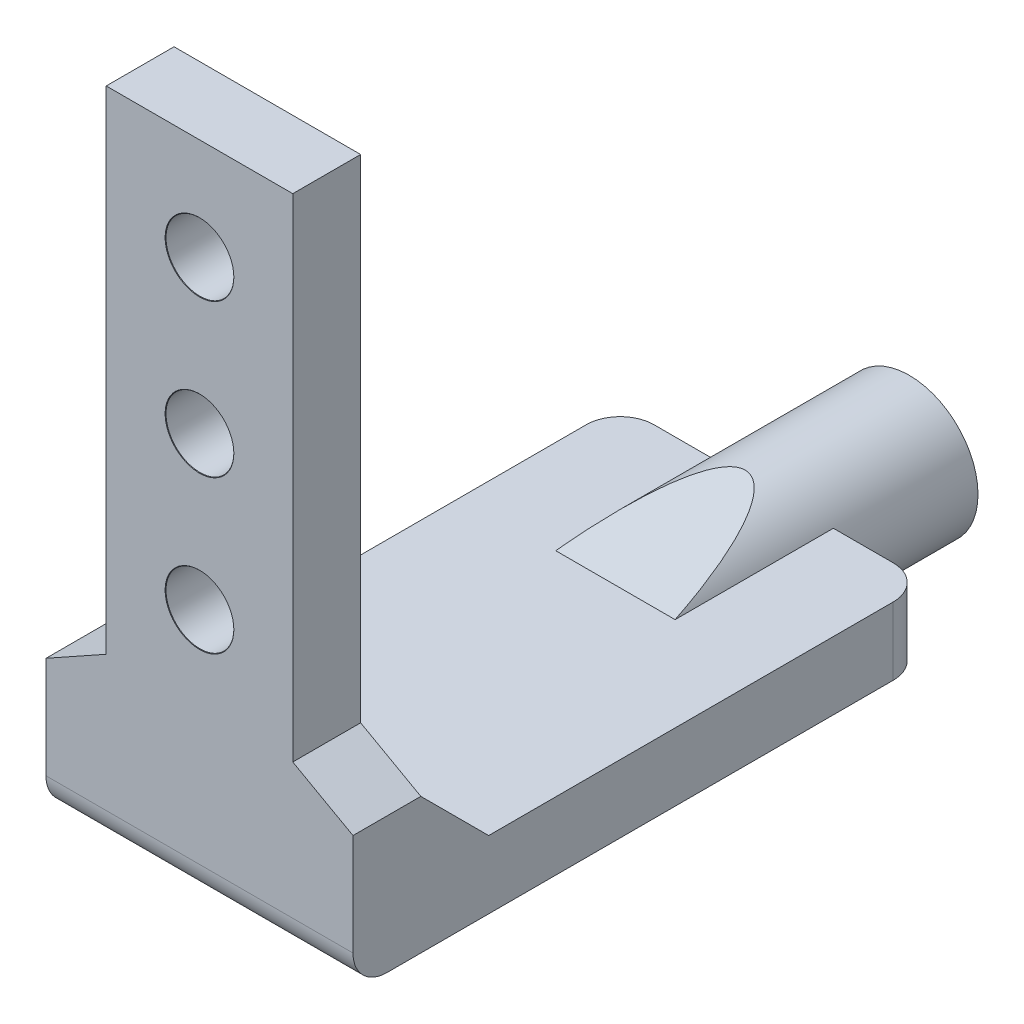
ISO-10303-21;
HEADER;
FILE_DESCRIPTION(('STEP AP214'),'2;1');
FILE_NAME('part.step','',(''),(''),'','','');
FILE_SCHEMA(('AUTOMOTIVE_DESIGN { 1 0 10303 214 1 1 1 1 }'));
ENDSEC;
DATA;
#1=APPLICATION_CONTEXT('core data for automotive mechanical design processes');
#2=APPLICATION_PROTOCOL_DEFINITION('international standard','automotive_design',2000,#1);
#3=PRODUCT_CONTEXT('',#1,'mechanical');
#4=PRODUCT('Part','Part','',(#3));
#5=PRODUCT_RELATED_PRODUCT_CATEGORY('part','',(#4));
#6=PRODUCT_DEFINITION_FORMATION('','',#4);
#7=PRODUCT_DEFINITION_CONTEXT('part definition',#1,'design');
#8=PRODUCT_DEFINITION('design','',#6,#7);
#9=PRODUCT_DEFINITION_SHAPE('','',#8);
#10=(LENGTH_UNIT() NAMED_UNIT(*) SI_UNIT(.MILLI.,.METRE.));
#11=(NAMED_UNIT(*) PLANE_ANGLE_UNIT() SI_UNIT($,.RADIAN.));
#12=(NAMED_UNIT(*) SI_UNIT($,.STERADIAN.) SOLID_ANGLE_UNIT());
#13=UNCERTAINTY_MEASURE_WITH_UNIT(LENGTH_MEASURE(1.E-05),#10,'distance_accuracy_value','');
#14=(GEOMETRIC_REPRESENTATION_CONTEXT(3) GLOBAL_UNCERTAINTY_ASSIGNED_CONTEXT((#13)) GLOBAL_UNIT_ASSIGNED_CONTEXT((#10,
#11,#12)) REPRESENTATION_CONTEXT('',''));
#15=CARTESIAN_POINT('',(0.,0.,0.));
#16=DIRECTION('',(0.,0.,1.));
#17=DIRECTION('',(1.,0.,0.));
#18=AXIS2_PLACEMENT_3D('',#15,#16,#17);
#19=CARTESIAN_POINT('',(-9.05,2.,41.85));
#20=DIRECTION('',(0.,-1.,0.));
#21=DIRECTION('',(0.,0.,-1.));
#22=AXIS2_PLACEMENT_3D('',#19,#20,#21);
#23=PLANE('',#22);
#24=DIRECTION('',(0.,0.,-1.));
#25=VECTOR('',#24,1.);
#26=CARTESIAN_POINT('',(-9.05,2.,41.85));
#27=LINE('',#26,#25);
#28=CARTESIAN_POINT('',(-9.05,2.,33.85));
#29=VERTEX_POINT('',#28);
#30=CARTESIAN_POINT('',(-9.05,2.,10.));
#31=VERTEX_POINT('',#30);
#32=EDGE_CURVE('E246',#29,#31,#27,.T.);
#33=ORIENTED_EDGE('',*,*,#32,.F.);
#34=DIRECTION('',(1.,0.,0.));
#35=VECTOR('',#34,1.);
#36=CARTESIAN_POINT('',(9.05,2.,33.85));
#37=LINE('',#36,#35);
#38=CARTESIAN_POINT('',(9.05,2.,33.85));
#39=VERTEX_POINT('',#38);
#40=EDGE_CURVE('E300',#29,#39,#37,.T.);
#41=ORIENTED_EDGE('',*,*,#40,.T.);
#42=DIRECTION('',(0.,0.,-1.));
#43=VECTOR('',#42,1.);
#44=CARTESIAN_POINT('',(9.05,2.,41.85));
#45=LINE('',#44,#43);
#46=CARTESIAN_POINT('',(9.05,2.,10.));
#47=VERTEX_POINT('',#46);
#48=EDGE_CURVE('E248',#39,#47,#45,.T.);
#49=ORIENTED_EDGE('',*,*,#48,.T.);
#50=CARTESIAN_POINT('',(7.05,2.,10.));
#51=DIRECTION('',(0.,-1.,0.));
#52=DIRECTION('',(0.,0.,-1.));
#53=AXIS2_PLACEMENT_3D('',#50,#51,#52);
#54=CIRCLE('',#53,2.);
#55=CARTESIAN_POINT('',(7.04999999999999,2.,8.));
#56=VERTEX_POINT('',#55);
#57=EDGE_CURVE('E287',#47,#56,#54,.F.);
#58=ORIENTED_EDGE('',*,*,#57,.T.);
#59=DIRECTION('',(-1.,0.,0.));
#60=VECTOR('',#59,1.);
#61=CARTESIAN_POINT('',(-9.05,2.,8.));
#62=LINE('',#61,#60);
#63=CARTESIAN_POINT('',(3.52171833058807,2.,8.));
#64=VERTEX_POINT('',#63);
#65=EDGE_CURVE('E239',#56,#64,#62,.T.);
#66=ORIENTED_EDGE('',*,*,#65,.T.);
#67=DIRECTION('',(0.,0.,-1.));
#68=VECTOR('',#67,1.);
#69=CARTESIAN_POINT('',(3.52171833058807,2.,8.));
#70=LINE('',#69,#68);
#71=CARTESIAN_POINT('',(3.52171833058807,2.,17.3301270189226));
#72=VERTEX_POINT('',#71);
#73=EDGE_CURVE('E257',#64,#72,#70,.F.);
#74=ORIENTED_EDGE('',*,*,#73,.T.);
#75=DIRECTION('',(-1.,0.,0.));
#76=VECTOR('',#75,1.);
#77=CARTESIAN_POINT('',(-9.05,2.,17.3301270189226));
#78=LINE('',#77,#76);
#79=CARTESIAN_POINT('',(-3.52171833058807,2.,17.3301270189226));
#80=VERTEX_POINT('',#79);
#81=EDGE_CURVE('E260',#72,#80,#78,.T.);
#82=ORIENTED_EDGE('',*,*,#81,.T.);
#83=DIRECTION('',(0.,0.,-1.));
#84=VECTOR('',#83,1.);
#85=CARTESIAN_POINT('',(-3.52171833058807,2.,17.3301270189226));
#86=LINE('',#85,#84);
#87=CARTESIAN_POINT('',(-3.52171833058807,2.,8.));
#88=VERTEX_POINT('',#87);
#89=EDGE_CURVE('E263',#80,#88,#86,.T.);
#90=ORIENTED_EDGE('',*,*,#89,.T.);
#91=CARTESIAN_POINT('',(-7.05,2.,8.));
#92=VERTEX_POINT('',#91);
#93=EDGE_CURVE('E231',#88,#92,#62,.T.);
#94=ORIENTED_EDGE('',*,*,#93,.T.);
#95=CARTESIAN_POINT('',(-7.05,2.,10.));
#96=DIRECTION('',(0.,-1.,0.));
#97=DIRECTION('',(0.,0.,-1.));
#98=AXIS2_PLACEMENT_3D('',#95,#96,#97);
#99=CIRCLE('',#98,2.);
#100=EDGE_CURVE('E289',#92,#31,#99,.F.);
#101=ORIENTED_EDGE('',*,*,#100,.T.);
#102=EDGE_LOOP('',(#33,#41,#49,#58,#66,#74,#82,#90,#94,#101));
#103=FACE_BOUND('',#102,.T.);
#104=ADVANCED_FACE('F45',(#103),#23,.F.);
#105=CARTESIAN_POINT('',(0.,0.,8.));
#106=DIRECTION('',(0.,0.,-1.));
#107=DIRECTION('',(-1.,0.,0.));
#108=AXIS2_PLACEMENT_3D('',#105,#106,#107);
#109=CYLINDRICAL_SURFACE('',#108,4.05);
#110=ORIENTED_EDGE('',*,*,#89,.F.);
#111=CARTESIAN_POINT('',(0.,0.,24.7942286340604));
#112=DIRECTION('',(0.,-0.965925826289069,-0.258819045102517));
#113=DIRECTION('',(0.,0.258819045102517,-0.965925826289069));
#114=AXIS2_PLACEMENT_3D('',#111,#112,#113);
#115=ELLIPSE('',#114,15.6479983858831,4.05);
#116=EDGE_CURVE('E265',#80,#72,#115,.T.);
#117=ORIENTED_EDGE('',*,*,#116,.T.);
#118=ORIENTED_EDGE('',*,*,#73,.F.);
#119=CARTESIAN_POINT('',(0.,0.,8.));
#120=DIRECTION('',(0.,0.,1.));
#121=DIRECTION('',(1.,0.,0.));
#122=AXIS2_PLACEMENT_3D('',#119,#120,#121);
#123=CIRCLE('',#122,4.05);
#124=CARTESIAN_POINT('',(3.52171833058807,-2.,8.));
#125=VERTEX_POINT('',#124);
#126=EDGE_CURVE('E251',#125,#64,#123,.T.);
#127=ORIENTED_EDGE('',*,*,#126,.F.);
#128=DIRECTION('',(0.,0.,-1.));
#129=VECTOR('',#128,1.);
#130=CARTESIAN_POINT('',(3.52171833058807,-2.,17.3301270189226));
#131=LINE('',#130,#129);
#132=CARTESIAN_POINT('',(3.52171833058807,-2.,17.3301270189226));
#133=VERTEX_POINT('',#132);
#134=EDGE_CURVE('E273',#133,#125,#131,.T.);
#135=ORIENTED_EDGE('',*,*,#134,.F.);
#136=CARTESIAN_POINT('',(0.,0.,24.7942286340604));
#137=DIRECTION('',(0.,0.965925826289069,-0.258819045102517));
#138=DIRECTION('',(0.,-0.258819045102517,-0.965925826289069));
#139=AXIS2_PLACEMENT_3D('',#136,#137,#138);
#140=ELLIPSE('',#139,15.6479983858831,4.05);
#141=CARTESIAN_POINT('',(-3.52171833058807,-2.,17.3301270189226));
#142=VERTEX_POINT('',#141);
#143=EDGE_CURVE('E275',#133,#142,#140,.T.);
#144=ORIENTED_EDGE('',*,*,#143,.T.);
#145=DIRECTION('',(0.,0.,-1.));
#146=VECTOR('',#145,1.);
#147=CARTESIAN_POINT('',(-3.52171833058807,-2.,8.));
#148=LINE('',#147,#146);
#149=CARTESIAN_POINT('',(-3.52171833058807,-2.,8.));
#150=VERTEX_POINT('',#149);
#151=EDGE_CURVE('E267',#150,#142,#148,.F.);
#152=ORIENTED_EDGE('',*,*,#151,.F.);
#153=EDGE_CURVE('E254',#88,#150,#123,.T.);
#154=ORIENTED_EDGE('',*,*,#153,.F.);
#155=EDGE_LOOP('',(#110,#117,#118,#127,#135,#144,#152,#154));
#156=FACE_BOUND('',#155,.T.);
#157=CARTESIAN_POINT('',(0.,0.,0.));
#158=DIRECTION('',(0.,0.,1.));
#159=DIRECTION('',(1.,0.,0.));
#160=AXIS2_PLACEMENT_3D('',#157,#158,#159);
#161=CIRCLE('',#160,4.05);
#162=CARTESIAN_POINT('',(4.05,0.,0.));
#163=VERTEX_POINT('',#162);
#164=EDGE_CURVE('E250',#163,#163,#161,.T.);
#165=ORIENTED_EDGE('',*,*,#164,.T.);
#166=EDGE_LOOP('',(#165));
#167=FACE_BOUND('',#166,.T.);
#168=ADVANCED_FACE('F356',(#156,#167),#109,.T.);
#169=CARTESIAN_POINT('',(0.,0.,0.));
#170=DIRECTION('',(0.,0.,1.));
#171=DIRECTION('',(1.,0.,0.));
#172=AXIS2_PLACEMENT_3D('',#169,#170,#171);
#173=PLANE('',#172);
#174=ORIENTED_EDGE('',*,*,#164,.F.);
#175=EDGE_LOOP('',(#174));
#176=FACE_BOUND('',#175,.T.);
#177=ADVANCED_FACE('F364',(#176),#173,.F.);
#178=CARTESIAN_POINT('',(0.,0.,8.));
#179=DIRECTION('',(0.,0.,-1.));
#180=DIRECTION('',(-1.,0.,0.));
#181=AXIS2_PLACEMENT_3D('',#178,#179,#180);
#182=PLANE('',#181);
#183=DIRECTION('',(1.,0.,0.));
#184=VECTOR('',#183,1.);
#185=CARTESIAN_POINT('',(-9.05,-2.,8.));
#186=LINE('',#185,#184);
#187=CARTESIAN_POINT('',(-7.05,-2.,8.));
#188=VERTEX_POINT('',#187);
#189=EDGE_CURVE('E236',#188,#150,#186,.T.);
#190=ORIENTED_EDGE('',*,*,#189,.F.);
#191=DIRECTION('',(0.,-1.,0.));
#192=VECTOR('',#191,1.);
#193=CARTESIAN_POINT('',(-7.05,2.,8.));
#194=LINE('',#193,#192);
#195=EDGE_CURVE('E285',#188,#92,#194,.F.);
#196=ORIENTED_EDGE('',*,*,#195,.T.);
#197=ORIENTED_EDGE('',*,*,#93,.F.);
#198=ORIENTED_EDGE('',*,*,#153,.T.);
#199=EDGE_LOOP('',(#190,#196,#197,#198));
#200=FACE_BOUND('',#199,.T.);
#201=ADVANCED_FACE('F373',(#200),#182,.T.);
#202=CARTESIAN_POINT('',(9.05,-2.,41.85));
#203=DIRECTION('',(-1.,0.,0.));
#204=DIRECTION('',(0.,0.,1.));
#205=AXIS2_PLACEMENT_3D('',#202,#203,#204);
#206=PLANE('',#205);
#207=DIRECTION('',(0.,-0.707106781186551,-0.707106781186544));
#208=VECTOR('',#207,1.);
#209=CARTESIAN_POINT('',(9.05,3.99999999999998,35.85));
#210=LINE('',#209,#208);
#211=CARTESIAN_POINT('',(9.05,6.00000000000004,37.85));
#212=VERTEX_POINT('',#211);
#213=EDGE_CURVE('E304',#39,#212,#210,.F.);
#214=ORIENTED_EDGE('',*,*,#213,.T.);
#215=DIRECTION('',(0.,0.,-1.));
#216=VECTOR('',#215,1.);
#217=CARTESIAN_POINT('',(9.05,6.00000000000004,41.85));
#218=LINE('',#217,#216);
#219=CARTESIAN_POINT('',(9.05,6.00000000000004,41.85));
#220=VERTEX_POINT('',#219);
#221=EDGE_CURVE('E197',#220,#212,#218,.T.);
#222=ORIENTED_EDGE('',*,*,#221,.F.);
#223=DIRECTION('',(0.,1.,0.));
#224=VECTOR('',#223,1.);
#225=CARTESIAN_POINT('',(9.05,-2.,41.85));
#226=LINE('',#225,#224);
#227=CARTESIAN_POINT('',(9.05,0.,41.85));
#228=VERTEX_POINT('',#227);
#229=EDGE_CURVE('E232',#228,#220,#226,.T.);
#230=ORIENTED_EDGE('',*,*,#229,.F.);
#231=CARTESIAN_POINT('',(9.05,0.,39.85));
#232=DIRECTION('',(-1.,0.,0.));
#233=DIRECTION('',(0.,0.,1.));
#234=AXIS2_PLACEMENT_3D('',#231,#232,#233);
#235=CIRCLE('',#234,2.);
#236=CARTESIAN_POINT('',(9.05,-2.,39.85));
#237=VERTEX_POINT('',#236);
#238=EDGE_CURVE('E316',#228,#237,#235,.F.);
#239=ORIENTED_EDGE('',*,*,#238,.T.);
#240=DIRECTION('',(0.,0.,-1.));
#241=VECTOR('',#240,1.);
#242=CARTESIAN_POINT('',(9.05,-2.,41.85));
#243=LINE('',#242,#241);
#244=CARTESIAN_POINT('',(9.05,-2.,10.));
#245=VERTEX_POINT('',#244);
#246=EDGE_CURVE('E238',#237,#245,#243,.T.);
#247=ORIENTED_EDGE('',*,*,#246,.T.);
#248=DIRECTION('',(0.,1.,0.));
#249=VECTOR('',#248,1.);
#250=CARTESIAN_POINT('',(9.05,2.,10.));
#251=LINE('',#250,#249);
#252=EDGE_CURVE('E292',#245,#47,#251,.T.);
#253=ORIENTED_EDGE('',*,*,#252,.T.);
#254=ORIENTED_EDGE('',*,*,#48,.F.);
#255=EDGE_LOOP('',(#214,#222,#230,#239,#247,#253,#254));
#256=FACE_BOUND('',#255,.T.);
#257=ADVANCED_FACE('F332',(#256),#206,.F.);
#258=CARTESIAN_POINT('',(-9.05,-2.,41.85));
#259=DIRECTION('',(1.,0.,0.));
#260=DIRECTION('',(0.,0.,-1.));
#261=AXIS2_PLACEMENT_3D('',#258,#259,#260);
#262=PLANE('',#261);
#263=DIRECTION('',(0.,-1.,0.));
#264=VECTOR('',#263,1.);
#265=CARTESIAN_POINT('',(-9.05,-2.,41.85));
#266=LINE('',#265,#264);
#267=CARTESIAN_POINT('',(-9.05,6.00000000000004,41.85));
#268=VERTEX_POINT('',#267);
#269=CARTESIAN_POINT('',(-9.05,0.,41.85));
#270=VERTEX_POINT('',#269);
#271=EDGE_CURVE('E235',#268,#270,#266,.T.);
#272=ORIENTED_EDGE('',*,*,#271,.F.);
#273=DIRECTION('',(0.,0.,-1.));
#274=VECTOR('',#273,1.);
#275=CARTESIAN_POINT('',(-9.05,6.00000000000004,41.85));
#276=LINE('',#275,#274);
#277=CARTESIAN_POINT('',(-9.05,6.00000000000004,37.85));
#278=VERTEX_POINT('',#277);
#279=EDGE_CURVE('E170',#268,#278,#276,.T.);
#280=ORIENTED_EDGE('',*,*,#279,.T.);
#281=DIRECTION('',(0.,0.707106781186551,0.707106781186544));
#282=VECTOR('',#281,1.);
#283=CARTESIAN_POINT('',(-9.05,3.99999999999998,35.85));
#284=LINE('',#283,#282);
#285=EDGE_CURVE('E302',#278,#29,#284,.F.);
#286=ORIENTED_EDGE('',*,*,#285,.T.);
#287=ORIENTED_EDGE('',*,*,#32,.T.);
#288=DIRECTION('',(0.,-1.,0.));
#289=VECTOR('',#288,1.);
#290=CARTESIAN_POINT('',(-9.05,-2.,10.));
#291=LINE('',#290,#289);
#292=CARTESIAN_POINT('',(-9.05,-2.,10.));
#293=VERTEX_POINT('',#292);
#294=EDGE_CURVE('E277',#31,#293,#291,.T.);
#295=ORIENTED_EDGE('',*,*,#294,.T.);
#296=DIRECTION('',(0.,0.,-1.));
#297=VECTOR('',#296,1.);
#298=CARTESIAN_POINT('',(-9.05,-2.,41.85));
#299=LINE('',#298,#297);
#300=CARTESIAN_POINT('',(-9.05,-2.,39.85));
#301=VERTEX_POINT('',#300);
#302=EDGE_CURVE('E244',#301,#293,#299,.T.);
#303=ORIENTED_EDGE('',*,*,#302,.F.);
#304=CARTESIAN_POINT('',(-9.05,0.,39.85));
#305=DIRECTION('',(1.,0.,0.));
#306=DIRECTION('',(0.,0.,-1.));
#307=AXIS2_PLACEMENT_3D('',#304,#305,#306);
#308=CIRCLE('',#307,2.);
#309=EDGE_CURVE('E11',#301,#270,#308,.F.);
#310=ORIENTED_EDGE('',*,*,#309,.T.);
#311=EDGE_LOOP('',(#272,#280,#286,#287,#295,#303,#310));
#312=FACE_BOUND('',#311,.T.);
#313=ADVANCED_FACE('F326',(#312),#262,.F.);
#314=CARTESIAN_POINT('',(-9.05,-2.,41.85));
#315=DIRECTION('',(0.,1.,0.));
#316=DIRECTION('',(0.,0.,1.));
#317=AXIS2_PLACEMENT_3D('',#314,#315,#316);
#318=PLANE('',#317);
#319=ORIENTED_EDGE('',*,*,#246,.F.);
#320=DIRECTION('',(1.,0.,0.));
#321=VECTOR('',#320,1.);
#322=CARTESIAN_POINT('',(-9.05,-2.,39.85));
#323=LINE('',#322,#321);
#324=EDGE_CURVE('E53',#237,#301,#323,.F.);
#325=ORIENTED_EDGE('',*,*,#324,.T.);
#326=ORIENTED_EDGE('',*,*,#302,.T.);
#327=CARTESIAN_POINT('',(-7.05,-2.,10.));
#328=DIRECTION('',(0.,1.,0.));
#329=DIRECTION('',(0.,0.,1.));
#330=AXIS2_PLACEMENT_3D('',#327,#328,#329);
#331=CIRCLE('',#330,2.);
#332=EDGE_CURVE('E283',#293,#188,#331,.F.);
#333=ORIENTED_EDGE('',*,*,#332,.T.);
#334=ORIENTED_EDGE('',*,*,#189,.T.);
#335=ORIENTED_EDGE('',*,*,#151,.T.);
#336=DIRECTION('',(1.,0.,0.));
#337=VECTOR('',#336,1.);
#338=CARTESIAN_POINT('',(-9.05,-2.,17.3301270189226));
#339=LINE('',#338,#337);
#340=EDGE_CURVE('E270',#142,#133,#339,.T.);
#341=ORIENTED_EDGE('',*,*,#340,.T.);
#342=ORIENTED_EDGE('',*,*,#134,.T.);
#343=CARTESIAN_POINT('',(7.04999999999999,-2.,8.));
#344=VERTEX_POINT('',#343);
#345=EDGE_CURVE('E241',#125,#344,#186,.T.);
#346=ORIENTED_EDGE('',*,*,#345,.T.);
#347=CARTESIAN_POINT('',(7.05,-2.,10.));
#348=DIRECTION('',(0.,1.,0.));
#349=DIRECTION('',(0.,0.,1.));
#350=AXIS2_PLACEMENT_3D('',#347,#348,#349);
#351=CIRCLE('',#350,2.);
#352=EDGE_CURVE('E280',#344,#245,#351,.F.);
#353=ORIENTED_EDGE('',*,*,#352,.T.);
#354=EDGE_LOOP('',(#319,#325,#326,#333,#334,#335,#341,#342,#346,#353));
#355=FACE_BOUND('',#354,.T.);
#356=ADVANCED_FACE('F321',(#355),#318,.F.);
#357=CARTESIAN_POINT('',(0.,0.,41.85));
#358=DIRECTION('',(0.,0.,-1.));
#359=DIRECTION('',(-1.,0.,0.));
#360=AXIS2_PLACEMENT_3D('',#357,#358,#359);
#361=PLANE('',#360);
#362=CARTESIAN_POINT('',(0.,31.,41.85));
#363=DIRECTION('',(0.,0.,1.));
#364=DIRECTION('',(1.,0.,0.));
#365=AXIS2_PLACEMENT_3D('',#362,#363,#364);
#366=CIRCLE('',#365,2.025);
#367=CARTESIAN_POINT('',(2.025,31.,41.85));
#368=VERTEX_POINT('',#367);
#369=EDGE_CURVE('E203',#368,#368,#366,.T.);
#370=ORIENTED_EDGE('',*,*,#369,.F.);
#371=EDGE_LOOP('',(#370));
#372=FACE_BOUND('',#371,.T.);
#373=CARTESIAN_POINT('',(0.,22.,41.85));
#374=DIRECTION('',(0.,0.,1.));
#375=DIRECTION('',(1.,0.,0.));
#376=AXIS2_PLACEMENT_3D('',#373,#374,#375);
#377=CIRCLE('',#376,2.025);
#378=CARTESIAN_POINT('',(2.025,22.,41.85));
#379=VERTEX_POINT('',#378);
#380=EDGE_CURVE('E213',#379,#379,#377,.T.);
#381=ORIENTED_EDGE('',*,*,#380,.F.);
#382=EDGE_LOOP('',(#381));
#383=FACE_BOUND('',#382,.T.);
#384=CARTESIAN_POINT('',(0.,13.,41.85));
#385=DIRECTION('',(0.,0.,1.));
#386=DIRECTION('',(1.,0.,0.));
#387=AXIS2_PLACEMENT_3D('',#384,#385,#386);
#388=CIRCLE('',#387,2.025);
#389=CARTESIAN_POINT('',(2.025,13.,41.85));
#390=VERTEX_POINT('',#389);
#391=EDGE_CURVE('E220',#390,#390,#388,.T.);
#392=ORIENTED_EDGE('',*,*,#391,.F.);
#393=EDGE_LOOP('',(#392));
#394=FACE_BOUND('',#393,.T.);
#395=DIRECTION('',(0.,-1.,0.));
#396=VECTOR('',#395,1.);
#397=CARTESIAN_POINT('',(-5.5,7.98000000000004,41.85));
#398=LINE('',#397,#396);
#399=CARTESIAN_POINT('',(-5.5,37.,41.85));
#400=VERTEX_POINT('',#399);
#401=CARTESIAN_POINT('',(-5.5,7.98000000000004,41.85));
#402=VERTEX_POINT('',#401);
#403=EDGE_CURVE('E60',#400,#402,#398,.T.);
#404=ORIENTED_EDGE('',*,*,#403,.T.);
#405=DIRECTION('',(-0.873343748456126,-0.48710440054736,0.));
#406=VECTOR('',#405,1.);
#407=CARTESIAN_POINT('',(-9.05,6.00000000000004,41.85));
#408=LINE('',#407,#406);
#409=EDGE_CURVE('E174',#402,#268,#408,.T.);
#410=ORIENTED_EDGE('',*,*,#409,.T.);
#411=ORIENTED_EDGE('',*,*,#271,.T.);
#412=DIRECTION('',(1.,0.,0.));
#413=VECTOR('',#412,1.);
#414=CARTESIAN_POINT('',(0.,0.,41.85));
#415=LINE('',#414,#413);
#416=EDGE_CURVE('E307',#270,#228,#415,.T.);
#417=ORIENTED_EDGE('',*,*,#416,.T.);
#418=ORIENTED_EDGE('',*,*,#229,.T.);
#419=DIRECTION('',(-0.873343748456126,0.48710440054736,0.));
#420=VECTOR('',#419,1.);
#421=CARTESIAN_POINT('',(9.05,6.00000000000004,41.85));
#422=LINE('',#421,#420);
#423=CARTESIAN_POINT('',(5.5,7.98000000000004,41.85));
#424=VERTEX_POINT('',#423);
#425=EDGE_CURVE('E192',#220,#424,#422,.T.);
#426=ORIENTED_EDGE('',*,*,#425,.T.);
#427=DIRECTION('',(0.,1.,0.));
#428=VECTOR('',#427,1.);
#429=CARTESIAN_POINT('',(5.5,7.98000000000004,41.85));
#430=LINE('',#429,#428);
#431=CARTESIAN_POINT('',(5.5,37.,41.85));
#432=VERTEX_POINT('',#431);
#433=EDGE_CURVE('E195',#424,#432,#430,.T.);
#434=ORIENTED_EDGE('',*,*,#433,.T.);
#435=DIRECTION('',(1.,0.,0.));
#436=VECTOR('',#435,1.);
#437=CARTESIAN_POINT('',(-9.05,37.,41.85));
#438=LINE('',#437,#436);
#439=EDGE_CURVE('E183',#400,#432,#438,.T.);
#440=ORIENTED_EDGE('',*,*,#439,.F.);
#441=EDGE_LOOP('',(#404,#410,#411,#417,#418,#426,#434,#440));
#442=FACE_BOUND('',#441,.T.);
#443=ADVANCED_FACE('F181',(#372,#383,#394,#442),#361,.F.);
#444=ORIENTED_EDGE('',*,*,#65,.F.);
#445=DIRECTION('',(0.,1.,0.));
#446=VECTOR('',#445,1.);
#447=CARTESIAN_POINT('',(7.05,-2.,8.));
#448=LINE('',#447,#446);
#449=EDGE_CURVE('E295',#56,#344,#448,.F.);
#450=ORIENTED_EDGE('',*,*,#449,.T.);
#451=ORIENTED_EDGE('',*,*,#345,.F.);
#452=ORIENTED_EDGE('',*,*,#126,.T.);
#453=EDGE_LOOP('',(#444,#450,#451,#452));
#454=FACE_BOUND('',#453,.T.);
#455=ADVANCED_FACE('F385',(#454),#182,.T.);
#456=CARTESIAN_POINT('',(-9.05,2.,17.3301270189226));
#457=DIRECTION('',(0.,-0.965925826289069,-0.258819045102517));
#458=DIRECTION('',(-1.,0.,0.));
#459=AXIS2_PLACEMENT_3D('',#456,#457,#458);
#460=PLANE('',#459);
#461=ORIENTED_EDGE('',*,*,#81,.F.);
#462=ORIENTED_EDGE('',*,*,#116,.F.);
#463=EDGE_LOOP('',(#461,#462));
#464=FACE_BOUND('',#463,.T.);
#465=ADVANCED_FACE('F378',(#464),#460,.F.);
#466=CARTESIAN_POINT('',(-9.05,-2.,17.3301270189226));
#467=DIRECTION('',(0.,0.965925826289069,-0.258819045102517));
#468=DIRECTION('',(1.,0.,0.));
#469=AXIS2_PLACEMENT_3D('',#466,#467,#468);
#470=PLANE('',#469);
#471=ORIENTED_EDGE('',*,*,#340,.F.);
#472=ORIENTED_EDGE('',*,*,#143,.F.);
#473=EDGE_LOOP('',(#471,#472));
#474=FACE_BOUND('',#473,.T.);
#475=ADVANCED_FACE('F384',(#474),#470,.F.);
#476=CARTESIAN_POINT('',(-7.05,-2.,10.));
#477=DIRECTION('',(0.,1.,0.));
#478=DIRECTION('',(0.,0.,1.));
#479=AXIS2_PLACEMENT_3D('',#476,#477,#478);
#480=CYLINDRICAL_SURFACE('',#479,2.);
#481=ORIENTED_EDGE('',*,*,#100,.F.);
#482=ORIENTED_EDGE('',*,*,#195,.F.);
#483=ORIENTED_EDGE('',*,*,#332,.F.);
#484=ORIENTED_EDGE('',*,*,#294,.F.);
#485=EDGE_LOOP('',(#481,#482,#483,#484));
#486=FACE_BOUND('',#485,.T.);
#487=ADVANCED_FACE('F392',(#486),#480,.T.);
#488=CARTESIAN_POINT('',(7.05,-2.,10.));
#489=DIRECTION('',(0.,-1.,0.));
#490=DIRECTION('',(0.,0.,-1.));
#491=AXIS2_PLACEMENT_3D('',#488,#489,#490);
#492=CYLINDRICAL_SURFACE('',#491,2.);
#493=ORIENTED_EDGE('',*,*,#352,.F.);
#494=ORIENTED_EDGE('',*,*,#449,.F.);
#495=ORIENTED_EDGE('',*,*,#57,.F.);
#496=ORIENTED_EDGE('',*,*,#252,.F.);
#497=EDGE_LOOP('',(#493,#494,#495,#496));
#498=FACE_BOUND('',#497,.T.);
#499=ADVANCED_FACE('F396',(#498),#492,.T.);
#500=CARTESIAN_POINT('',(-9.05,37.,37.85));
#501=DIRECTION('',(0.,0.,1.));
#502=DIRECTION('',(1.,0.,0.));
#503=AXIS2_PLACEMENT_3D('',#500,#501,#502);
#504=PLANE('',#503);
#505=CARTESIAN_POINT('',(0.,31.,37.85));
#506=DIRECTION('',(0.,0.,1.));
#507=DIRECTION('',(1.,0.,0.));
#508=AXIS2_PLACEMENT_3D('',#505,#506,#507);
#509=CIRCLE('',#508,1.99999999999999);
#510=CARTESIAN_POINT('',(1.99999999999999,31.,37.85));
#511=VERTEX_POINT('',#510);
#512=EDGE_CURVE('E212',#511,#511,#509,.T.);
#513=ORIENTED_EDGE('',*,*,#512,.T.);
#514=EDGE_LOOP('',(#513));
#515=FACE_BOUND('',#514,.T.);
#516=CARTESIAN_POINT('',(0.,22.,37.85));
#517=DIRECTION('',(0.,0.,1.));
#518=DIRECTION('',(1.,0.,0.));
#519=AXIS2_PLACEMENT_3D('',#516,#517,#518);
#520=CIRCLE('',#519,1.99999999999999);
#521=CARTESIAN_POINT('',(1.99999999999999,22.,37.85));
#522=VERTEX_POINT('',#521);
#523=EDGE_CURVE('E219',#522,#522,#520,.T.);
#524=ORIENTED_EDGE('',*,*,#523,.T.);
#525=EDGE_LOOP('',(#524));
#526=FACE_BOUND('',#525,.T.);
#527=CARTESIAN_POINT('',(0.,13.,37.85));
#528=DIRECTION('',(0.,0.,1.));
#529=DIRECTION('',(1.,0.,0.));
#530=AXIS2_PLACEMENT_3D('',#527,#528,#529);
#531=CIRCLE('',#530,1.99999999999999);
#532=CARTESIAN_POINT('',(1.99999999999999,13.,37.85));
#533=VERTEX_POINT('',#532);
#534=EDGE_CURVE('E226',#533,#533,#531,.T.);
#535=ORIENTED_EDGE('',*,*,#534,.T.);
#536=EDGE_LOOP('',(#535));
#537=FACE_BOUND('',#536,.T.);
#538=DIRECTION('',(-1.,0.,0.));
#539=VECTOR('',#538,1.);
#540=CARTESIAN_POINT('',(-9.05,6.00000000000004,37.85));
#541=LINE('',#540,#539);
#542=EDGE_CURVE('E297',#212,#278,#541,.T.);
#543=ORIENTED_EDGE('',*,*,#542,.T.);
#544=DIRECTION('',(-0.873343748456126,-0.48710440054736,0.));
#545=VECTOR('',#544,1.);
#546=CARTESIAN_POINT('',(-9.05,6.00000000000004,37.85));
#547=LINE('',#546,#545);
#548=CARTESIAN_POINT('',(-5.5,7.98000000000004,37.85));
#549=VERTEX_POINT('',#548);
#550=EDGE_CURVE('E184',#549,#278,#547,.T.);
#551=ORIENTED_EDGE('',*,*,#550,.F.);
#552=DIRECTION('',(0.,-1.,0.));
#553=VECTOR('',#552,1.);
#554=CARTESIAN_POINT('',(-5.5,7.98000000000004,37.85));
#555=LINE('',#554,#553);
#556=CARTESIAN_POINT('',(-5.5,37.,37.85));
#557=VERTEX_POINT('',#556);
#558=EDGE_CURVE('E167',#557,#549,#555,.T.);
#559=ORIENTED_EDGE('',*,*,#558,.F.);
#560=DIRECTION('',(-1.,0.,0.));
#561=VECTOR('',#560,1.);
#562=CARTESIAN_POINT('',(-9.05,37.,37.85));
#563=LINE('',#562,#561);
#564=CARTESIAN_POINT('',(5.5,37.,37.85));
#565=VERTEX_POINT('',#564);
#566=EDGE_CURVE('E228',#565,#557,#563,.T.);
#567=ORIENTED_EDGE('',*,*,#566,.F.);
#568=DIRECTION('',(0.,1.,0.));
#569=VECTOR('',#568,1.);
#570=CARTESIAN_POINT('',(5.5,7.98000000000004,37.85));
#571=LINE('',#570,#569);
#572=CARTESIAN_POINT('',(5.5,7.98000000000004,37.85));
#573=VERTEX_POINT('',#572);
#574=EDGE_CURVE('E68',#573,#565,#571,.T.);
#575=ORIENTED_EDGE('',*,*,#574,.F.);
#576=DIRECTION('',(-0.873343748456126,0.48710440054736,0.));
#577=VECTOR('',#576,1.);
#578=CARTESIAN_POINT('',(9.05,6.00000000000004,37.85));
#579=LINE('',#578,#577);
#580=EDGE_CURVE('E189',#212,#573,#579,.T.);
#581=ORIENTED_EDGE('',*,*,#580,.F.);
#582=EDGE_LOOP('',(#543,#551,#559,#567,#575,#581));
#583=FACE_BOUND('',#582,.T.);
#584=ADVANCED_FACE('F340',(#515,#526,#537,#583),#504,.F.);
#585=CARTESIAN_POINT('',(0.,37.,0.));
#586=DIRECTION('',(0.,-1.,0.));
#587=DIRECTION('',(0.,0.,-1.));
#588=AXIS2_PLACEMENT_3D('',#585,#586,#587);
#589=PLANE('',#588);
#590=ORIENTED_EDGE('',*,*,#566,.T.);
#591=DIRECTION('',(0.,0.,-1.));
#592=VECTOR('',#591,1.);
#593=CARTESIAN_POINT('',(-5.5,37.,41.85));
#594=LINE('',#593,#592);
#595=EDGE_CURVE('E171',#400,#557,#594,.T.);
#596=ORIENTED_EDGE('',*,*,#595,.F.);
#597=ORIENTED_EDGE('',*,*,#439,.T.);
#598=DIRECTION('',(0.,0.,-1.));
#599=VECTOR('',#598,1.);
#600=CARTESIAN_POINT('',(5.5,37.,41.85));
#601=LINE('',#600,#599);
#602=EDGE_CURVE('E201',#432,#565,#601,.T.);
#603=ORIENTED_EDGE('',*,*,#602,.T.);
#604=EDGE_LOOP('',(#590,#596,#597,#603));
#605=FACE_BOUND('',#604,.T.);
#606=ADVANCED_FACE('F343',(#605),#589,.F.);
#607=CARTESIAN_POINT('',(-9.05,6.00000000000004,37.85));
#608=DIRECTION('',(0.,0.707106781186544,-0.707106781186551));
#609=DIRECTION('',(1.,0.,0.));
#610=AXIS2_PLACEMENT_3D('',#607,#608,#609);
#611=PLANE('',#610);
#612=ORIENTED_EDGE('',*,*,#213,.F.);
#613=ORIENTED_EDGE('',*,*,#40,.F.);
#614=ORIENTED_EDGE('',*,*,#285,.F.);
#615=ORIENTED_EDGE('',*,*,#542,.F.);
#616=EDGE_LOOP('',(#612,#613,#614,#615));
#617=FACE_BOUND('',#616,.T.);
#618=ADVANCED_FACE('F400',(#617),#611,.T.);
#619=CARTESIAN_POINT('',(0.,13.,41.85));
#620=DIRECTION('',(0.,0.,1.));
#621=DIRECTION('',(1.,0.,0.));
#622=AXIS2_PLACEMENT_3D('',#619,#620,#621);
#623=CYLINDRICAL_SURFACE('',#622,1.99999999999999);
#624=CARTESIAN_POINT('',(0.,13.,41.825));
#625=DIRECTION('',(0.,0.,1.));
#626=DIRECTION('',(1.,0.,0.));
#627=AXIS2_PLACEMENT_3D('',#624,#625,#626);
#628=CIRCLE('',#627,1.99999999999999);
#629=CARTESIAN_POINT('',(1.99999999999999,13.,41.825));
#630=VERTEX_POINT('',#629);
#631=EDGE_CURVE('E223',#630,#630,#628,.T.);
#632=ORIENTED_EDGE('',*,*,#631,.T.);
#633=EDGE_LOOP('',(#632));
#634=FACE_BOUND('',#633,.T.);
#635=ORIENTED_EDGE('',*,*,#534,.F.);
#636=EDGE_LOOP('',(#635));
#637=FACE_BOUND('',#636,.T.);
#638=ADVANCED_FACE('F404',(#634,#637),#623,.F.);
#639=CARTESIAN_POINT('',(0.,13.,41.85));
#640=DIRECTION('',(0.,0.,1.));
#641=DIRECTION('',(1.,0.,0.));
#642=AXIS2_PLACEMENT_3D('',#639,#640,#641);
#643=CONICAL_SURFACE('',#642,2.025,0.785398163397726);
#644=ORIENTED_EDGE('',*,*,#631,.F.);
#645=EDGE_LOOP('',(#644));
#646=FACE_BOUND('',#645,.T.);
#647=ORIENTED_EDGE('',*,*,#391,.T.);
#648=EDGE_LOOP('',(#647));
#649=FACE_BOUND('',#648,.T.);
#650=ADVANCED_FACE('F411',(#646,#649),#643,.F.);
#651=CARTESIAN_POINT('',(0.,22.,41.85));
#652=DIRECTION('',(0.,0.,1.));
#653=DIRECTION('',(1.,0.,0.));
#654=AXIS2_PLACEMENT_3D('',#651,#652,#653);
#655=CYLINDRICAL_SURFACE('',#654,1.99999999999999);
#656=CARTESIAN_POINT('',(0.,22.,41.825));
#657=DIRECTION('',(0.,0.,1.));
#658=DIRECTION('',(1.,0.,0.));
#659=AXIS2_PLACEMENT_3D('',#656,#657,#658);
#660=CIRCLE('',#659,1.99999999999999);
#661=CARTESIAN_POINT('',(1.99999999999999,22.,41.825));
#662=VERTEX_POINT('',#661);
#663=EDGE_CURVE('E216',#662,#662,#660,.T.);
#664=ORIENTED_EDGE('',*,*,#663,.T.);
#665=EDGE_LOOP('',(#664));
#666=FACE_BOUND('',#665,.T.);
#667=ORIENTED_EDGE('',*,*,#523,.F.);
#668=EDGE_LOOP('',(#667));
#669=FACE_BOUND('',#668,.T.);
#670=ADVANCED_FACE('F531',(#666,#669),#655,.F.);
#671=CARTESIAN_POINT('',(0.,22.,41.85));
#672=DIRECTION('',(0.,0.,1.));
#673=DIRECTION('',(1.,0.,0.));
#674=AXIS2_PLACEMENT_3D('',#671,#672,#673);
#675=CONICAL_SURFACE('',#674,2.025,0.785398163397726);
#676=ORIENTED_EDGE('',*,*,#663,.F.);
#677=EDGE_LOOP('',(#676));
#678=FACE_BOUND('',#677,.T.);
#679=ORIENTED_EDGE('',*,*,#380,.T.);
#680=EDGE_LOOP('',(#679));
#681=FACE_BOUND('',#680,.T.);
#682=ADVANCED_FACE('F539',(#678,#681),#675,.F.);
#683=CARTESIAN_POINT('',(0.,31.,41.85));
#684=DIRECTION('',(0.,0.,1.));
#685=DIRECTION('',(1.,0.,0.));
#686=AXIS2_PLACEMENT_3D('',#683,#684,#685);
#687=CYLINDRICAL_SURFACE('',#686,1.99999999999999);
#688=CARTESIAN_POINT('',(0.,31.,41.825));
#689=DIRECTION('',(0.,0.,1.));
#690=DIRECTION('',(1.,0.,0.));
#691=AXIS2_PLACEMENT_3D('',#688,#689,#690);
#692=CIRCLE('',#691,1.99999999999999);
#693=CARTESIAN_POINT('',(1.99999999999999,31.,41.825));
#694=VERTEX_POINT('',#693);
#695=EDGE_CURVE('E209',#694,#694,#692,.T.);
#696=ORIENTED_EDGE('',*,*,#695,.T.);
#697=EDGE_LOOP('',(#696));
#698=FACE_BOUND('',#697,.T.);
#699=ORIENTED_EDGE('',*,*,#512,.F.);
#700=EDGE_LOOP('',(#699));
#701=FACE_BOUND('',#700,.T.);
#702=ADVANCED_FACE('F547',(#698,#701),#687,.F.);
#703=CARTESIAN_POINT('',(0.,31.,41.85));
#704=DIRECTION('',(0.,0.,1.));
#705=DIRECTION('',(1.,0.,0.));
#706=AXIS2_PLACEMENT_3D('',#703,#704,#705);
#707=CONICAL_SURFACE('',#706,2.025,0.785398163397726);
#708=ORIENTED_EDGE('',*,*,#695,.F.);
#709=EDGE_LOOP('',(#708));
#710=FACE_BOUND('',#709,.T.);
#711=ORIENTED_EDGE('',*,*,#369,.T.);
#712=EDGE_LOOP('',(#711));
#713=FACE_BOUND('',#712,.T.);
#714=ADVANCED_FACE('F353',(#710,#713),#707,.F.);
#715=CARTESIAN_POINT('',(0.,0.,39.85));
#716=DIRECTION('',(1.,0.,0.));
#717=DIRECTION('',(0.,0.,-1.));
#718=AXIS2_PLACEMENT_3D('',#715,#716,#717);
#719=CYLINDRICAL_SURFACE('',#718,2.);
#720=ORIENTED_EDGE('',*,*,#309,.F.);
#721=ORIENTED_EDGE('',*,*,#324,.F.);
#722=ORIENTED_EDGE('',*,*,#238,.F.);
#723=ORIENTED_EDGE('',*,*,#416,.F.);
#724=EDGE_LOOP('',(#720,#721,#722,#723));
#725=FACE_BOUND('',#724,.T.);
#726=ADVANCED_FACE('F47',(#725),#719,.T.);
#727=CARTESIAN_POINT('',(5.5,7.98000000000004,41.85));
#728=DIRECTION('',(-1.,0.,0.));
#729=DIRECTION('',(0.,0.,1.));
#730=AXIS2_PLACEMENT_3D('',#727,#728,#729);
#731=PLANE('',#730);
#732=ORIENTED_EDGE('',*,*,#574,.T.);
#733=ORIENTED_EDGE('',*,*,#602,.F.);
#734=ORIENTED_EDGE('',*,*,#433,.F.);
#735=DIRECTION('',(0.,0.,-1.));
#736=VECTOR('',#735,1.);
#737=CARTESIAN_POINT('',(5.5,7.98000000000004,41.85));
#738=LINE('',#737,#736);
#739=EDGE_CURVE('E204',#424,#573,#738,.T.);
#740=ORIENTED_EDGE('',*,*,#739,.T.);
#741=EDGE_LOOP('',(#732,#733,#734,#740));
#742=FACE_BOUND('',#741,.T.);
#743=ADVANCED_FACE('F345',(#742),#731,.F.);
#744=CARTESIAN_POINT('',(9.05,6.00000000000004,41.85));
#745=DIRECTION('',(-0.48710440054736,-0.873343748456126,0.));
#746=DIRECTION('',(0.873343748456126,-0.48710440054736,0.));
#747=AXIS2_PLACEMENT_3D('',#744,#745,#746);
#748=PLANE('',#747);
#749=ORIENTED_EDGE('',*,*,#580,.T.);
#750=ORIENTED_EDGE('',*,*,#739,.F.);
#751=ORIENTED_EDGE('',*,*,#425,.F.);
#752=ORIENTED_EDGE('',*,*,#221,.T.);
#753=EDGE_LOOP('',(#749,#750,#751,#752));
#754=FACE_BOUND('',#753,.T.);
#755=ADVANCED_FACE('F338',(#754),#748,.F.);
#756=CARTESIAN_POINT('',(-9.05,6.00000000000004,41.85));
#757=DIRECTION('',(0.48710440054736,-0.873343748456126,0.));
#758=DIRECTION('',(0.873343748456126,0.48710440054736,0.));
#759=AXIS2_PLACEMENT_3D('',#756,#757,#758);
#760=PLANE('',#759);
#761=ORIENTED_EDGE('',*,*,#550,.T.);
#762=ORIENTED_EDGE('',*,*,#279,.F.);
#763=ORIENTED_EDGE('',*,*,#409,.F.);
#764=DIRECTION('',(0.,0.,-1.));
#765=VECTOR('',#764,1.);
#766=CARTESIAN_POINT('',(-5.5,7.98000000000004,41.85));
#767=LINE('',#766,#765);
#768=EDGE_CURVE('E163',#402,#549,#767,.T.);
#769=ORIENTED_EDGE('',*,*,#768,.T.);
#770=EDGE_LOOP('',(#761,#762,#763,#769));
#771=FACE_BOUND('',#770,.T.);
#772=ADVANCED_FACE('F175',(#771),#760,.F.);
#773=CARTESIAN_POINT('',(-5.5,7.98000000000004,41.85));
#774=DIRECTION('',(1.,0.,0.));
#775=DIRECTION('',(0.,0.,-1.));
#776=AXIS2_PLACEMENT_3D('',#773,#774,#775);
#777=PLANE('',#776);
#778=ORIENTED_EDGE('',*,*,#558,.T.);
#779=ORIENTED_EDGE('',*,*,#768,.F.);
#780=ORIENTED_EDGE('',*,*,#403,.F.);
#781=ORIENTED_EDGE('',*,*,#595,.T.);
#782=EDGE_LOOP('',(#778,#779,#780,#781));
#783=FACE_BOUND('',#782,.T.);
#784=ADVANCED_FACE('F165',(#783),#777,.F.);
#785=CLOSED_SHELL('',(#104,#168,#177,#201,#257,#313,#356,#443,#455,#465,#475,#487,#499,#584,
#606,#618,#638,#650,#670,#682,#702,#714,#726,#743,#755,#772,#784));
#786=MANIFOLD_SOLID_BREP('B2',#785);
#787=ADVANCED_BREP_SHAPE_REPRESENTATION('',(#18,#786),#14);
#788=SHAPE_DEFINITION_REPRESENTATION(#9,#787);
ENDSEC;
END-ISO-10303-21;
